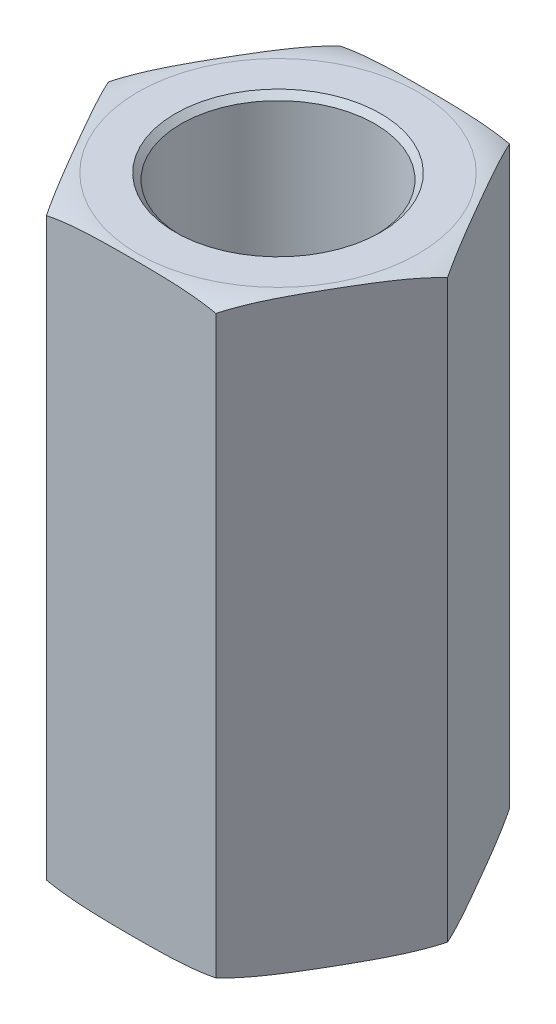
ISO-10303-21;
HEADER;
FILE_DESCRIPTION(('STEP AP214'),'2;1');
FILE_NAME('part.step','',(''),(''),'','','');
FILE_SCHEMA(('AUTOMOTIVE_DESIGN { 1 0 10303 214 1 1 1 1 }'));
ENDSEC;
DATA;
#1=APPLICATION_CONTEXT('core data for automotive mechanical design processes');
#2=APPLICATION_PROTOCOL_DEFINITION('international standard','automotive_design',2000,#1);
#3=PRODUCT_CONTEXT('',#1,'mechanical');
#4=PRODUCT('Part','Part','',(#3));
#5=PRODUCT_RELATED_PRODUCT_CATEGORY('part','',(#4));
#6=PRODUCT_DEFINITION_FORMATION('','',#4);
#7=PRODUCT_DEFINITION_CONTEXT('part definition',#1,'design');
#8=PRODUCT_DEFINITION('design','',#6,#7);
#9=PRODUCT_DEFINITION_SHAPE('','',#8);
#10=(LENGTH_UNIT() NAMED_UNIT(*) SI_UNIT(.MILLI.,.METRE.));
#11=(NAMED_UNIT(*) PLANE_ANGLE_UNIT() SI_UNIT($,.RADIAN.));
#12=(NAMED_UNIT(*) SI_UNIT($,.STERADIAN.) SOLID_ANGLE_UNIT());
#13=UNCERTAINTY_MEASURE_WITH_UNIT(LENGTH_MEASURE(1.E-05),#10,'distance_accuracy_value','');
#14=(GEOMETRIC_REPRESENTATION_CONTEXT(3) GLOBAL_UNCERTAINTY_ASSIGNED_CONTEXT((#13)) GLOBAL_UNIT_ASSIGNED_CONTEXT((#10,
#11,#12)) REPRESENTATION_CONTEXT('',''));
#15=CARTESIAN_POINT('',(0.,0.,0.));
#16=DIRECTION('',(0.,0.,1.));
#17=DIRECTION('',(1.,0.,0.));
#18=AXIS2_PLACEMENT_3D('',#15,#16,#17);
#19=CARTESIAN_POINT('',(3.66617420935412,6.35,0.));
#20=DIRECTION('',(-0.866025403784439,0.,0.5));
#21=DIRECTION('',(0.5,0.,0.866025403784439));
#22=AXIS2_PLACEMENT_3D('',#19,#20,#21);
#23=PLANE('',#22);
#24=DIRECTION('',(0.,1.,0.));
#25=VECTOR('',#24,1.);
#26=CARTESIAN_POINT('',(1.83308710467704,6.35,-3.175));
#27=LINE('',#26,#25);
#28=CARTESIAN_POINT('',(1.83308710467705,-6.223,-3.175));
#29=VERTEX_POINT('',#28);
#30=CARTESIAN_POINT('',(1.83308710467706,6.223,-3.175));
#31=VERTEX_POINT('',#30);
#32=EDGE_CURVE('E300',#29,#31,#27,.T.);
#33=ORIENTED_EDGE('',*,*,#32,.T.);
#34=CARTESIAN_POINT('',(3.66617420935412,6.223,0.));
#35=CARTESIAN_POINT('',(3.62797961467394,6.23890141489968,-0.0661549785605611));
#36=CARTESIAN_POINT('',(3.58956810864156,6.2524886076105,-0.132685658603882));
#37=CARTESIAN_POINT('',(3.5124905179571,6.27581619794021,-0.266187961794374));
#38=CARTESIAN_POINT('',(3.47382473049845,6.28556047713974,-0.33315907018741));
#39=CARTESIAN_POINT('',(3.39641631867871,6.3019966530451,-0.467234372392409));
#40=CARTESIAN_POINT('',(3.3576739963331,6.30869453286691,-0.534338043098217));
#41=CARTESIAN_POINT('',(3.28009834620111,6.31977675729319,-0.668703010557023));
#42=CARTESIAN_POINT('',(3.24126499587768,6.32416045047396,-0.735964346345314));
#43=CARTESIAN_POINT('',(3.16354065964311,6.33124030042628,-0.870586845688153));
#44=CARTESIAN_POINT('',(3.12464965374472,6.33393552375912,-0.937948043861629));
#45=CARTESIAN_POINT('',(3.04685144594589,6.33815319837134,-1.07269849250701));
#46=CARTESIAN_POINT('',(3.00794424351965,6.33967560802717,-1.14008774388963));
#47=CARTESIAN_POINT('',(2.93051517598868,6.34192270588903,-1.27419882283594));
#48=CARTESIAN_POINT('',(2.89199336248929,6.34265524681808,-1.34092056101658));
#49=CARTESIAN_POINT('',(2.81494778346138,6.34357673025741,-1.47436741839149));
#50=CARTESIAN_POINT('',(2.77642401791433,6.3437656658949,-1.54109253761784));
#51=CARTESIAN_POINT('',(2.69935964431006,6.34366599668056,-1.67457194815391));
#52=CARTESIAN_POINT('',(2.66081903631815,6.34337718117655,-1.7413262393505));
#53=CARTESIAN_POINT('',(2.58373908085323,6.34222198621899,-1.87483263846089));
#54=CARTESIAN_POINT('',(2.54519973341238,6.34135559703857,-1.94158474631899));
#55=CARTESIAN_POINT('',(2.46812969629763,6.33878619406563,-2.07507396634296));
#56=CARTESIAN_POINT('',(2.42959900625957,6.33708322716165,-2.14181107913956));
#57=CARTESIAN_POINT('',(2.352556513409,6.3324387229726,-2.27525259109851));
#58=CARTESIAN_POINT('',(2.31404470975434,6.3294972471358,-2.3419569917195));
#59=CARTESIAN_POINT('',(2.25084206239936,6.32321741247487,-2.45142718811118));
#60=CARTESIAN_POINT('',(2.22613849337002,6.32039801104631,-2.49421502479829));
#61=CARTESIAN_POINT('',(2.17676945272221,6.31386967943035,-2.57972471152123));
#62=CARTESIAN_POINT('',(2.15210397034177,6.31016108091389,-2.62244658019735));
#63=CARTESIAN_POINT('',(2.1028275381169,6.30168027114968,-2.70779586442654));
#64=CARTESIAN_POINT('',(2.07821657107524,6.29690846570083,-2.7504233097661));
#65=CARTESIAN_POINT('',(2.02900094683545,6.28609877125158,-2.83566727147563));
#66=CARTESIAN_POINT('',(2.0043964608546,6.28005773130841,-2.87828349128859));
#67=CARTESIAN_POINT('',(1.95527325900931,6.26651383541611,-2.96336737271509));
#68=CARTESIAN_POINT('',(1.93075459617612,6.25901019780296,-3.00583494247583));
#69=CARTESIAN_POINT('',(1.8818215737317,6.24232035070844,-3.09058942351747));
#70=CARTESIAN_POINT('',(1.85740744053269,6.23313149780328,-3.13287594264091));
#71=CARTESIAN_POINT('',(1.83308710467705,6.223,-3.175));
#72=B_SPLINE_CURVE_WITH_KNOTS('',3,(#34,#35,#36,#37,#38,#39,#40,#41,#42,#43,#44,#45,#46,#47,#48,
#49,#50,#51,#52,#53,#54,#55,#56,#57,#58,#59,#60,#61,#62,#63,#64,#65,#66,#67,#68,#69,#70,#71),
.UNSPECIFIED.,.F.,.F.,(4,2,2,2,2,2,2,2,2,2,2,2,2,2,2,2,2,2,4),(0.,0.233977307817956,
0.467717675040722,0.700996973557543,0.934341903229807,1.16781571967247,1.40129782179833,
1.6324366580968,1.86357841666628,2.09482211846307,2.32606971471509,2.55730435147413,
2.7885275169443,2.93698369265101,3.08538458004485,3.23372892334593,3.38244598546619,
3.53124274626087,3.68027493713585),.UNSPECIFIED.);
#73=CARTESIAN_POINT('',(3.66617420935412,6.223,0.));
#74=VERTEX_POINT('',#73);
#75=EDGE_CURVE('E94',#74,#31,#72,.T.);
#76=ORIENTED_EDGE('',*,*,#75,.F.);
#77=DIRECTION('',(0.,1.,0.));
#78=VECTOR('',#77,1.);
#79=CARTESIAN_POINT('',(3.66617420935412,6.35,0.));
#80=LINE('',#79,#78);
#81=CARTESIAN_POINT('',(3.66617420935412,-6.223,0.));
#82=VERTEX_POINT('',#81);
#83=EDGE_CURVE('E297',#74,#82,#80,.F.);
#84=ORIENTED_EDGE('',*,*,#83,.T.);
#85=CARTESIAN_POINT('',(1.83308710467705,-6.223,-3.17500000000001));
#86=CARTESIAN_POINT('',(1.87128169935723,-6.23890141489968,-3.10884502143945));
#87=CARTESIAN_POINT('',(1.90969320538961,-6.2524886076105,-3.04231434139613));
#88=CARTESIAN_POINT('',(1.98677079607407,-6.2758161979402,-2.90881203820564));
#89=CARTESIAN_POINT('',(2.02543658353272,-6.28556047713974,-2.8418409298126));
#90=CARTESIAN_POINT('',(2.10284499535245,-6.30199665304509,-2.70776562760761));
#91=CARTESIAN_POINT('',(2.14158731769806,-6.30869453286691,-2.6406619569018));
#92=CARTESIAN_POINT('',(2.21916296783006,-6.31977675729319,-2.506296989443));
#93=CARTESIAN_POINT('',(2.25799631815348,-6.32416045047396,-2.43903565365471));
#94=CARTESIAN_POINT('',(2.33572065438805,-6.33124030042628,-2.30441315431187));
#95=CARTESIAN_POINT('',(2.37461166028644,-6.33393552375912,-2.2370519561384));
#96=CARTESIAN_POINT('',(2.45240986808527,-6.33815319837134,-2.10230150749301));
#97=CARTESIAN_POINT('',(2.49131707051151,-6.33967560802717,-2.0349122561104));
#98=CARTESIAN_POINT('',(2.56874613804247,-6.34192270588903,-1.90080117716409));
#99=CARTESIAN_POINT('',(2.60726795154186,-6.34265524681808,-1.83407943898346));
#100=CARTESIAN_POINT('',(2.68431353056977,-6.34357673025741,-1.70063258160855));
#101=CARTESIAN_POINT('',(2.72283729611682,-6.3437656658949,-1.63390746238219));
#102=CARTESIAN_POINT('',(2.79990166972109,-6.34366599668056,-1.50042805184613));
#103=CARTESIAN_POINT('',(2.838442277713,-6.34337718117655,-1.43367376064954));
#104=CARTESIAN_POINT('',(2.91552223317792,-6.34222198621899,-1.30016736153915));
#105=CARTESIAN_POINT('',(2.95406158061877,-6.34135559703857,-1.23341525368106));
#106=CARTESIAN_POINT('',(3.03113161773352,-6.33878619406563,-1.09992603365709));
#107=CARTESIAN_POINT('',(3.06966230777158,-6.33708322716165,-1.03318892086049));
#108=CARTESIAN_POINT('',(3.14670480062215,-6.3324387229726,-0.899747408901539));
#109=CARTESIAN_POINT('',(3.18521660427681,-6.3294972471358,-0.833043008280551));
#110=CARTESIAN_POINT('',(3.24841925163178,-6.32321741247488,-0.72357281188887));
#111=CARTESIAN_POINT('',(3.27312282066113,-6.32039801104631,-0.68078497520176));
#112=CARTESIAN_POINT('',(3.32249186130894,-6.31386967943036,-0.595275288478811));
#113=CARTESIAN_POINT('',(3.34715734368938,-6.3101610809139,-0.552553419802693));
#114=CARTESIAN_POINT('',(3.39643377591425,-6.30168027114969,-0.467204135573495));
#115=CARTESIAN_POINT('',(3.42104474295592,-6.29690846570084,-0.424576690233926));
#116=CARTESIAN_POINT('',(3.47026036719571,-6.28609877125159,-0.339332728524397));
#117=CARTESIAN_POINT('',(3.49486485317657,-6.28005773130841,-0.296716508711431));
#118=CARTESIAN_POINT('',(3.54398805502186,-6.26651383541611,-0.211632627284922));
#119=CARTESIAN_POINT('',(3.56850671785505,-6.25901019780296,-0.169165057524186));
#120=CARTESIAN_POINT('',(3.61743974029947,-6.24232035070844,-0.084410576482538));
#121=CARTESIAN_POINT('',(3.64185387349848,-6.23313149780328,-0.0421240573590946));
#122=CARTESIAN_POINT('',(3.66617420935412,-6.223,0.));
#123=B_SPLINE_CURVE_WITH_KNOTS('',3,(#85,#86,#87,#88,#89,#90,#91,#92,#93,#94,#95,#96,#97,#98,
#99,#100,#101,#102,#103,#104,#105,#106,#107,#108,#109,#110,#111,#112,#113,#114,#115,#116,#117,
#118,#119,#120,#121,#122),.UNSPECIFIED.,.F.,.F.,(4,2,2,2,2,2,2,2,2,2,2,2,2,2,2,2,2,2,4),(0.,
0.233977307817952,0.467717675040713,0.700996973557529,0.934341903229788,1.16781571967244,
1.4012978217983,1.63243665809676,1.86357841666625,2.09482211846303,2.32606971471504,
2.55730435147408,2.78852751694424,2.93698369265097,3.08538458004482,3.23372892334591,
3.38244598546617,3.53124274626087,3.68027493713586),.UNSPECIFIED.);
#124=EDGE_CURVE('E143',#29,#82,#123,.T.);
#125=ORIENTED_EDGE('',*,*,#124,.F.);
#126=EDGE_LOOP('',(#33,#76,#84,#125));
#127=FACE_BOUND('',#126,.T.);
#128=ADVANCED_FACE('F14',(#127),#23,.F.);
#129=CARTESIAN_POINT('',(1.83308710467706,6.35,3.17499999999999));
#130=DIRECTION('',(-0.866025403784439,0.,-0.5));
#131=DIRECTION('',(-0.5,0.,0.866025403784439));
#132=AXIS2_PLACEMENT_3D('',#129,#130,#131);
#133=PLANE('',#132);
#134=ORIENTED_EDGE('',*,*,#83,.F.);
#135=CARTESIAN_POINT('',(1.83308710467706,6.223,3.17499999999999));
#136=CARTESIAN_POINT('',(1.87128169935724,6.23890141489968,3.10884502143943));
#137=CARTESIAN_POINT('',(1.90969320538962,6.2524886076105,3.04231434139611));
#138=CARTESIAN_POINT('',(1.98677079607408,6.27581619794021,2.90881203820562));
#139=CARTESIAN_POINT('',(2.02543658353273,6.28556047713974,2.84184092981258));
#140=CARTESIAN_POINT('',(2.10284499535247,6.3019966530451,2.70776562760758));
#141=CARTESIAN_POINT('',(2.14158731769808,6.30869453286691,2.64066195690177));
#142=CARTESIAN_POINT('',(2.21916296783007,6.31977675729319,2.50629698944297));
#143=CARTESIAN_POINT('',(2.2579963181535,6.32416045047396,2.43903565365468));
#144=CARTESIAN_POINT('',(2.33572065438807,6.33124030042628,2.30441315431184));
#145=CARTESIAN_POINT('',(2.37461166028646,6.33393552375912,2.23705195613836));
#146=CARTESIAN_POINT('',(2.45240986808529,6.33815319837134,2.10230150749298));
#147=CARTESIAN_POINT('',(2.49131707051153,6.33967560802717,2.03491225611036));
#148=CARTESIAN_POINT('',(2.5687461380425,6.34192270588903,1.90080117716405));
#149=CARTESIAN_POINT('',(2.60726795154189,6.34265524681808,1.83407943898341));
#150=CARTESIAN_POINT('',(2.6843135305698,6.34357673025741,1.7006325816085));
#151=CARTESIAN_POINT('',(2.72283729611685,6.3437656658949,1.63390746238215));
#152=CARTESIAN_POINT('',(2.79990166972112,6.34366599668056,1.50042805184608));
#153=CARTESIAN_POINT('',(2.83844227771304,6.34337718117655,1.43367376064949));
#154=CARTESIAN_POINT('',(2.91552223317796,6.34222198621899,1.3001673615391));
#155=CARTESIAN_POINT('',(2.9540615806188,6.34135559703857,1.233415253681));
#156=CARTESIAN_POINT('',(3.03113161773355,6.33878619406563,1.09992603365703));
#157=CARTESIAN_POINT('',(3.06966230777161,6.33708322716165,1.03318892086043));
#158=CARTESIAN_POINT('',(3.14670480062218,6.3324387229726,0.899747408901478));
#159=CARTESIAN_POINT('',(3.18521660427684,6.3294972471358,0.833043008280487));
#160=CARTESIAN_POINT('',(3.24841925163182,6.32321741247487,0.723572811888809));
#161=CARTESIAN_POINT('',(3.27312282066116,6.32039801104631,0.680784975201703));
#162=CARTESIAN_POINT('',(3.32249186130897,6.31386967943035,0.595275288478763));
#163=CARTESIAN_POINT('',(3.34715734368941,6.31016108091389,0.552553419802648));
#164=CARTESIAN_POINT('',(3.39643377591428,6.30168027114968,0.467204135573458));
#165=CARTESIAN_POINT('',(3.42104474295594,6.29690846570083,0.424576690233893));
#166=CARTESIAN_POINT('',(3.47026036719572,6.28609877125158,0.339332728524371));
#167=CARTESIAN_POINT('',(3.49486485317658,6.28005773130841,0.29671650871141));
#168=CARTESIAN_POINT('',(3.54398805502187,6.26651383541611,0.211632627284908));
#169=CARTESIAN_POINT('',(3.56850671785506,6.25901019780296,0.169165057524176));
#170=CARTESIAN_POINT('',(3.61743974029948,6.24232035070844,0.0844105764825357));
#171=CARTESIAN_POINT('',(3.64185387349849,6.23313149780328,0.0421240573590963));
#172=CARTESIAN_POINT('',(3.66617420935412,6.223,0.));
#173=B_SPLINE_CURVE_WITH_KNOTS('',3,(#135,#136,#137,#138,#139,#140,#141,#142,#143,#144,#145,
#146,#147,#148,#149,#150,#151,#152,#153,#154,#155,#156,#157,#158,#159,#160,#161,#162,#163,#164,
#165,#166,#167,#168,#169,#170,#171,#172),.UNSPECIFIED.,.F.,.F.,(4,2,2,2,2,2,2,2,2,2,2,2,2,2,2,2,
2,2,4),(0.,0.233977307817956,0.467717675040722,0.700996973557543,0.934341903229808,
1.16781571967247,1.40129782179833,1.6324366580968,1.86357841666628,2.09482211846307,
2.32606971471509,2.55730435147413,2.7885275169443,2.93698369265101,3.08538458004485,
3.23372892334593,3.38244598546618,3.53124274626086,3.68027493713584),.UNSPECIFIED.);
#174=CARTESIAN_POINT('',(1.83308710467706,6.223,3.17499999999999));
#175=VERTEX_POINT('',#174);
#176=EDGE_CURVE('E171',#175,#74,#173,.T.);
#177=ORIENTED_EDGE('',*,*,#176,.F.);
#178=DIRECTION('',(0.,1.,0.));
#179=VECTOR('',#178,1.);
#180=CARTESIAN_POINT('',(1.83308710467706,6.35,3.17499999999999));
#181=LINE('',#180,#179);
#182=CARTESIAN_POINT('',(1.83308710467706,-6.223,3.17499999999999));
#183=VERTEX_POINT('',#182);
#184=EDGE_CURVE('E295',#175,#183,#181,.F.);
#185=ORIENTED_EDGE('',*,*,#184,.T.);
#186=CARTESIAN_POINT('',(3.66617420935412,-6.223,0.));
#187=CARTESIAN_POINT('',(3.62797961467394,-6.23890141489968,0.0661549785605662));
#188=CARTESIAN_POINT('',(3.58956810864156,-6.2524886076105,0.132685658603887));
#189=CARTESIAN_POINT('',(3.5124905179571,-6.27581619794021,0.266187961794379));
#190=CARTESIAN_POINT('',(3.47382473049845,-6.28556047713974,0.333159070187415));
#191=CARTESIAN_POINT('',(3.39641631867871,-6.3019966530451,0.467234372392414));
#192=CARTESIAN_POINT('',(3.3576739963331,-6.30869453286691,0.534338043098222));
#193=CARTESIAN_POINT('',(3.28009834620111,-6.31977675729319,0.668703010557028));
#194=CARTESIAN_POINT('',(3.24126499587768,-6.32416045047396,0.73596434634532));
#195=CARTESIAN_POINT('',(3.16354065964311,-6.33124030042628,0.870586845688159));
#196=CARTESIAN_POINT('',(3.12464965374472,-6.33393552375912,0.937948043861634));
#197=CARTESIAN_POINT('',(3.04685144594589,-6.33815319837134,1.07269849250702));
#198=CARTESIAN_POINT('',(3.00794424351965,-6.33967560802717,1.14008774388963));
#199=CARTESIAN_POINT('',(2.93051517598868,-6.34192270588903,1.27419882283595));
#200=CARTESIAN_POINT('',(2.89199336248929,-6.34265524681808,1.34092056101658));
#201=CARTESIAN_POINT('',(2.81494778346138,-6.34357673025741,1.47436741839149));
#202=CARTESIAN_POINT('',(2.77642401791433,-6.3437656658949,1.54109253761785));
#203=CARTESIAN_POINT('',(2.69935964431006,-6.34366599668056,1.67457194815392));
#204=CARTESIAN_POINT('',(2.66081903631815,-6.34337718117655,1.74132623935051));
#205=CARTESIAN_POINT('',(2.58373908085322,-6.34222198621899,1.8748326384609));
#206=CARTESIAN_POINT('',(2.54519973341238,-6.34135559703857,1.941584746319));
#207=CARTESIAN_POINT('',(2.46812969629763,-6.33878619406563,2.07507396634296));
#208=CARTESIAN_POINT('',(2.42959900625957,-6.33708322716165,2.14181107913957));
#209=CARTESIAN_POINT('',(2.352556513409,-6.3324387229726,2.27525259109852));
#210=CARTESIAN_POINT('',(2.31404470975434,-6.3294972471358,2.34195699171951));
#211=CARTESIAN_POINT('',(2.25084206239936,-6.32321741247487,2.45142718811119));
#212=CARTESIAN_POINT('',(2.22613849337002,-6.32039801104631,2.49421502479829));
#213=CARTESIAN_POINT('',(2.17676945272221,-6.31386967943035,2.57972471152123));
#214=CARTESIAN_POINT('',(2.15210397034177,-6.31016108091389,2.62244658019735));
#215=CARTESIAN_POINT('',(2.1028275381169,-6.30168027114968,2.70779586442654));
#216=CARTESIAN_POINT('',(2.07821657107524,-6.29690846570083,2.7504233097661));
#217=CARTESIAN_POINT('',(2.02900094683546,-6.28609877125158,2.83566727147563));
#218=CARTESIAN_POINT('',(2.0043964608546,-6.28005773130841,2.87828349128859));
#219=CARTESIAN_POINT('',(1.95527325900931,-6.26651383541611,2.96336737271509));
#220=CARTESIAN_POINT('',(1.93075459617612,-6.25901019780296,3.00583494247582));
#221=CARTESIAN_POINT('',(1.88182157373171,-6.24232035070844,3.09058942351746));
#222=CARTESIAN_POINT('',(1.8574074405327,-6.23313149780328,3.1328759426409));
#223=CARTESIAN_POINT('',(1.83308710467706,-6.223,3.17499999999999));
#224=B_SPLINE_CURVE_WITH_KNOTS('',3,(#186,#187,#188,#189,#190,#191,#192,#193,#194,#195,#196,
#197,#198,#199,#200,#201,#202,#203,#204,#205,#206,#207,#208,#209,#210,#211,#212,#213,#214,#215,
#216,#217,#218,#219,#220,#221,#222,#223),.UNSPECIFIED.,.F.,.F.,(4,2,2,2,2,2,2,2,2,2,2,2,2,2,2,2,
2,2,4),(0.,0.233977307817956,0.467717675040723,0.700996973557543,0.934341903229807,
1.16781571967247,1.40129782179833,1.6324366580968,1.86357841666628,2.09482211846307,
2.32606971471509,2.55730435147414,2.7885275169443,2.93698369265102,3.08538458004485,
3.23372892334593,3.38244598546618,3.53124274626086,3.68027493713584),.UNSPECIFIED.);
#225=EDGE_CURVE('E150',#82,#183,#224,.T.);
#226=ORIENTED_EDGE('',*,*,#225,.F.);
#227=EDGE_LOOP('',(#134,#177,#185,#226));
#228=FACE_BOUND('',#227,.T.);
#229=ADVANCED_FACE('F162',(#228),#133,.F.);
#230=CARTESIAN_POINT('',(1.83308710467706,6.35,-3.175));
#231=DIRECTION('',(0.,0.,1.));
#232=DIRECTION('',(1.,0.,0.));
#233=AXIS2_PLACEMENT_3D('',#230,#231,#232);
#234=PLANE('',#233);
#235=DIRECTION('',(0.,1.,0.));
#236=VECTOR('',#235,1.);
#237=CARTESIAN_POINT('',(-1.83308710467707,6.35,-3.175));
#238=LINE('',#237,#236);
#239=CARTESIAN_POINT('',(-1.83308710467707,-6.223,-3.175));
#240=VERTEX_POINT('',#239);
#241=CARTESIAN_POINT('',(-1.83308710467706,6.223,-3.17500000000001));
#242=VERTEX_POINT('',#241);
#243=EDGE_CURVE('E101',#240,#242,#238,.T.);
#244=ORIENTED_EDGE('',*,*,#243,.T.);
#245=CARTESIAN_POINT('',(1.83308710467706,6.223,-3.175));
#246=CARTESIAN_POINT('',(1.73237579828683,6.24394001415179,-3.175));
#247=CARTESIAN_POINT('',(1.63096506893486,6.26088534953273,-3.175));
#248=CARTESIAN_POINT('',(1.42767146651469,6.28849716439842,-3.175));
#249=CARTESIAN_POINT('',(1.32579191427254,6.29918756587531,-3.175));
#250=CARTESIAN_POINT('',(1.12177634709137,6.31612804080793,-3.175));
#251=CARTESIAN_POINT('',(1.0196405664338,6.32238127071887,-3.175));
#252=CARTESIAN_POINT('',(0.815663681397375,6.33190280641833,-3.175));
#253=CARTESIAN_POINT('',(0.713823115514573,6.3351834044999,-3.175));
#254=CARTESIAN_POINT('',(0.510018485441651,6.33994548487028,-3.175));
#255=CARTESIAN_POINT('',(0.408054390577976,6.34142541008817,-3.175));
#256=CARTESIAN_POINT('',(0.20406020033787,6.34331468183792,-3.175));
#257=CARTESIAN_POINT('',(0.102030100168935,6.3437234241492,-3.175));
#258=CARTESIAN_POINT('',(-0.102030100168934,6.3437234241492,-3.175));
#259=CARTESIAN_POINT('',(-0.204060200337869,6.34331468183792,-3.175));
#260=CARTESIAN_POINT('',(-0.408054390577974,6.34142541008817,-3.175));
#261=CARTESIAN_POINT('',(-0.510018485441649,6.33994548487028,-3.175));
#262=CARTESIAN_POINT('',(-0.71382311551457,6.3351834044999,-3.175));
#263=CARTESIAN_POINT('',(-0.815663681397372,6.33190280641833,-3.175));
#264=CARTESIAN_POINT('',(-1.01964056643379,6.32238127071887,-3.175));
#265=CARTESIAN_POINT('',(-1.12177634709137,6.31612804080793,-3.175));
#266=CARTESIAN_POINT('',(-1.32579191427253,6.29918756587531,-3.175));
#267=CARTESIAN_POINT('',(-1.42767146651468,6.28849716439842,-3.175));
#268=CARTESIAN_POINT('',(-1.63096506893485,6.26088534953273,-3.175));
#269=CARTESIAN_POINT('',(-1.73237579828682,6.24394001415179,-3.175));
#270=CARTESIAN_POINT('',(-1.83308710467705,6.223,-3.175));
#271=B_SPLINE_CURVE_WITH_KNOTS('',3,(#245,#246,#247,#248,#249,#250,#251,#252,#253,#254,#255,
#256,#257,#258,#259,#260,#261,#262,#263,#264,#265,#266,#267,#268,#269,#270),.UNSPECIFIED.,.F.,
.F.,(4,2,2,2,2,2,2,2,2,2,2,2,4),(0.,0.308333242342807,0.615479423308234,0.922406891130008,
1.2280592962085,1.53397581645216,1.84006485747889,2.14615389850561,2.45207041874927,
2.75772282382776,3.06465029164953,3.37179647261496,3.68012971495777),.UNSPECIFIED.);
#272=EDGE_CURVE('E86',#31,#242,#271,.T.);
#273=ORIENTED_EDGE('',*,*,#272,.F.);
#274=ORIENTED_EDGE('',*,*,#32,.F.);
#275=CARTESIAN_POINT('',(-1.83308710467707,-6.223,-3.175));
#276=CARTESIAN_POINT('',(-1.73237579828684,-6.24394001415179,-3.175));
#277=CARTESIAN_POINT('',(-1.63096506893487,-6.26088534953273,-3.175));
#278=CARTESIAN_POINT('',(-1.4276714665147,-6.28849716439842,-3.175));
#279=CARTESIAN_POINT('',(-1.32579191427255,-6.2991875658753,-3.175));
#280=CARTESIAN_POINT('',(-1.12177634709138,-6.31612804080793,-3.175));
#281=CARTESIAN_POINT('',(-1.0196405664338,-6.32238127071887,-3.175));
#282=CARTESIAN_POINT('',(-0.81566368139738,-6.33190280641833,-3.175));
#283=CARTESIAN_POINT('',(-0.713823115514577,-6.3351834044999,-3.175));
#284=CARTESIAN_POINT('',(-0.510018485441654,-6.33994548487028,-3.175));
#285=CARTESIAN_POINT('',(-0.408054390577979,-6.34142541008817,-3.175));
#286=CARTESIAN_POINT('',(-0.204060200337872,-6.34331468183792,-3.175));
#287=CARTESIAN_POINT('',(-0.102030100168936,-6.3437234241492,-3.175));
#288=CARTESIAN_POINT('',(0.102030100168934,-6.3437234241492,-3.175));
#289=CARTESIAN_POINT('',(0.204060200337869,-6.34331468183792,-3.175));
#290=CARTESIAN_POINT('',(0.408054390577974,-6.34142541008817,-3.175));
#291=CARTESIAN_POINT('',(0.510018485441648,-6.33994548487028,-3.175));
#292=CARTESIAN_POINT('',(0.713823115514568,-6.3351834044999,-3.175));
#293=CARTESIAN_POINT('',(0.81566368139737,-6.33190280641833,-3.175));
#294=CARTESIAN_POINT('',(1.01964056643379,-6.32238127071887,-3.175));
#295=CARTESIAN_POINT('',(1.12177634709137,-6.31612804080793,-3.175));
#296=CARTESIAN_POINT('',(1.32579191427253,-6.29918756587531,-3.175));
#297=CARTESIAN_POINT('',(1.42767146651468,-6.28849716439842,-3.175));
#298=CARTESIAN_POINT('',(1.63096506893485,-6.26088534953273,-3.175));
#299=CARTESIAN_POINT('',(1.73237579828682,-6.24394001415179,-3.175));
#300=CARTESIAN_POINT('',(1.83308710467705,-6.223,-3.175));
#301=B_SPLINE_CURVE_WITH_KNOTS('',3,(#275,#276,#277,#278,#279,#280,#281,#282,#283,#284,#285,
#286,#287,#288,#289,#290,#291,#292,#293,#294,#295,#296,#297,#298,#299,#300),.UNSPECIFIED.,.F.,
.F.,(4,2,2,2,2,2,2,2,2,2,2,2,4),(0.,0.308333242342808,0.615479423308238,0.922406891130013,
1.22805929620851,1.53397581645217,1.8400648574789,2.14615389850562,2.45207041874928,
2.75772282382777,3.06465029164954,3.37179647261497,3.68012971495777),.UNSPECIFIED.);
#302=EDGE_CURVE('E103',#240,#29,#301,.T.);
#303=ORIENTED_EDGE('',*,*,#302,.F.);
#304=EDGE_LOOP('',(#244,#273,#274,#303));
#305=FACE_BOUND('',#304,.T.);
#306=ADVANCED_FACE('F102',(#305),#234,.F.);
#307=CARTESIAN_POINT('',(-1.83308710467707,6.35,3.175));
#308=DIRECTION('',(0.,0.,-1.));
#309=DIRECTION('',(-1.,0.,0.));
#310=AXIS2_PLACEMENT_3D('',#307,#308,#309);
#311=PLANE('',#310);
#312=ORIENTED_EDGE('',*,*,#184,.F.);
#313=CARTESIAN_POINT('',(-1.83308710467706,6.223,3.175));
#314=CARTESIAN_POINT('',(-1.73237579828684,6.24394001415179,3.175));
#315=CARTESIAN_POINT('',(-1.63096506893486,6.26088534953273,3.175));
#316=CARTESIAN_POINT('',(-1.42767146651469,6.28849716439842,3.175));
#317=CARTESIAN_POINT('',(-1.32579191427254,6.29918756587531,3.175));
#318=CARTESIAN_POINT('',(-1.12177634709138,6.31612804080793,3.175));
#319=CARTESIAN_POINT('',(-1.0196405664338,6.32238127071887,3.175));
#320=CARTESIAN_POINT('',(-0.815663681397378,6.33190280641833,3.175));
#321=CARTESIAN_POINT('',(-0.713823115514575,6.3351834044999,3.175));
#322=CARTESIAN_POINT('',(-0.510018485441652,6.33994548487028,3.175));
#323=CARTESIAN_POINT('',(-0.408054390577977,6.34142541008817,3.175));
#324=CARTESIAN_POINT('',(-0.204060200337871,6.34331468183792,3.175));
#325=CARTESIAN_POINT('',(-0.102030100168935,6.3437234241492,3.17499999999999));
#326=CARTESIAN_POINT('',(0.102030100168935,6.3437234241492,3.17499999999999));
#327=CARTESIAN_POINT('',(0.204060200337871,6.34331468183792,3.17499999999999));
#328=CARTESIAN_POINT('',(0.408054390577978,6.34142541008817,3.17499999999999));
#329=CARTESIAN_POINT('',(0.510018485441652,6.33994548487028,3.17499999999999));
#330=CARTESIAN_POINT('',(0.713823115514575,6.3351834044999,3.17499999999999));
#331=CARTESIAN_POINT('',(0.815663681397378,6.33190280641833,3.17499999999999));
#332=CARTESIAN_POINT('',(1.0196405664338,6.32238127071887,3.17499999999999));
#333=CARTESIAN_POINT('',(1.12177634709138,6.31612804080793,3.17499999999999));
#334=CARTESIAN_POINT('',(1.32579191427254,6.29918756587531,3.17499999999999));
#335=CARTESIAN_POINT('',(1.42767146651469,6.28849716439842,3.17499999999999));
#336=CARTESIAN_POINT('',(1.63096506893486,6.26088534953273,3.17499999999999));
#337=CARTESIAN_POINT('',(1.73237579828684,6.24394001415179,3.17499999999999));
#338=CARTESIAN_POINT('',(1.83308710467706,6.223,3.17499999999999));
#339=B_SPLINE_CURVE_WITH_KNOTS('',3,(#313,#314,#315,#316,#317,#318,#319,#320,#321,#322,#323,
#324,#325,#326,#327,#328,#329,#330,#331,#332,#333,#334,#335,#336,#337,#338),.UNSPECIFIED.,.F.,
.F.,(4,2,2,2,2,2,2,2,2,2,2,2,4),(0.,0.308333242342808,0.615479423308237,0.922406891130011,
1.2280592962085,1.53397581645216,1.84006485747889,2.14615389850562,2.45207041874928,
2.75772282382777,3.06465029164955,3.37179647261498,3.68012971495778),.UNSPECIFIED.);
#340=CARTESIAN_POINT('',(-1.83308710467707,6.223,3.175));
#341=VERTEX_POINT('',#340);
#342=EDGE_CURVE('E97',#341,#175,#339,.T.);
#343=ORIENTED_EDGE('',*,*,#342,.F.);
#344=DIRECTION('',(0.,1.,0.));
#345=VECTOR('',#344,1.);
#346=CARTESIAN_POINT('',(-1.83308710467707,6.35,3.175));
#347=LINE('',#346,#345);
#348=CARTESIAN_POINT('',(-1.83308710467706,-6.223,3.175));
#349=VERTEX_POINT('',#348);
#350=EDGE_CURVE('E105',#341,#349,#347,.F.);
#351=ORIENTED_EDGE('',*,*,#350,.T.);
#352=CARTESIAN_POINT('',(1.83308710467706,-6.223,3.17499999999999));
#353=CARTESIAN_POINT('',(1.73237579828684,-6.24394001415179,3.17499999999999));
#354=CARTESIAN_POINT('',(1.63096506893486,-6.26088534953273,3.17499999999999));
#355=CARTESIAN_POINT('',(1.4276714665147,-6.28849716439842,3.17499999999999));
#356=CARTESIAN_POINT('',(1.32579191427254,-6.29918756587531,3.17499999999999));
#357=CARTESIAN_POINT('',(1.12177634709138,-6.31612804080793,3.17499999999999));
#358=CARTESIAN_POINT('',(1.0196405664338,-6.32238127071887,3.17499999999999));
#359=CARTESIAN_POINT('',(0.815663681397379,-6.33190280641833,3.17499999999999));
#360=CARTESIAN_POINT('',(0.713823115514576,-6.3351834044999,3.17499999999999));
#361=CARTESIAN_POINT('',(0.510018485441653,-6.33994548487028,3.17499999999999));
#362=CARTESIAN_POINT('',(0.408054390577978,-6.34142541008817,3.17499999999999));
#363=CARTESIAN_POINT('',(0.204060200337871,-6.34331468183792,3.17499999999999));
#364=CARTESIAN_POINT('',(0.102030100168935,-6.3437234241492,3.17499999999999));
#365=CARTESIAN_POINT('',(-0.102030100168935,-6.3437234241492,3.17499999999999));
#366=CARTESIAN_POINT('',(-0.204060200337871,-6.34331468183792,3.175));
#367=CARTESIAN_POINT('',(-0.408054390577977,-6.34142541008817,3.175));
#368=CARTESIAN_POINT('',(-0.510018485441652,-6.33994548487028,3.175));
#369=CARTESIAN_POINT('',(-0.713823115514575,-6.3351834044999,3.175));
#370=CARTESIAN_POINT('',(-0.815663681397377,-6.33190280641833,3.175));
#371=CARTESIAN_POINT('',(-1.0196405664338,-6.32238127071887,3.175));
#372=CARTESIAN_POINT('',(-1.12177634709138,-6.31612804080793,3.175));
#373=CARTESIAN_POINT('',(-1.32579191427254,-6.29918756587531,3.175));
#374=CARTESIAN_POINT('',(-1.42767146651469,-6.28849716439842,3.175));
#375=CARTESIAN_POINT('',(-1.63096506893486,-6.26088534953273,3.175));
#376=CARTESIAN_POINT('',(-1.73237579828684,-6.24394001415179,3.175));
#377=CARTESIAN_POINT('',(-1.83308710467706,-6.223,3.175));
#378=B_SPLINE_CURVE_WITH_KNOTS('',3,(#352,#353,#354,#355,#356,#357,#358,#359,#360,#361,#362,
#363,#364,#365,#366,#367,#368,#369,#370,#371,#372,#373,#374,#375,#376,#377),.UNSPECIFIED.,.F.,
.F.,(4,2,2,2,2,2,2,2,2,2,2,2,4),(0.,0.308333242342808,0.615479423308237,0.922406891130012,
1.22805929620851,1.53397581645217,1.84006485747889,2.14615389850562,2.45207041874928,
2.75772282382777,3.06465029164955,3.37179647261498,3.68012971495779),.UNSPECIFIED.);
#379=EDGE_CURVE('E193',#183,#349,#378,.T.);
#380=ORIENTED_EDGE('',*,*,#379,.F.);
#381=EDGE_LOOP('',(#312,#343,#351,#380));
#382=FACE_BOUND('',#381,.T.);
#383=ADVANCED_FACE('F186',(#382),#311,.F.);
#384=CARTESIAN_POINT('',(-3.66617420935413,6.35,0.));
#385=DIRECTION('',(0.866025403784439,0.,-0.499999999999999));
#386=DIRECTION('',(-0.499999999999999,0.,-0.866025403784439));
#387=AXIS2_PLACEMENT_3D('',#384,#385,#386);
#388=PLANE('',#387);
#389=ORIENTED_EDGE('',*,*,#350,.F.);
#390=CARTESIAN_POINT('',(-3.66617420935412,6.223,0.));
#391=CARTESIAN_POINT('',(-3.62797961467395,6.23890141489968,0.0661549785605656));
#392=CARTESIAN_POINT('',(-3.58956810864157,6.2524886076105,0.132685658603886));
#393=CARTESIAN_POINT('',(-3.5124905179571,6.27581619794021,0.266187961794378));
#394=CARTESIAN_POINT('',(-3.47382473049846,6.28556047713974,0.333159070187413));
#395=CARTESIAN_POINT('',(-3.39641631867872,6.30199665304509,0.467234372392413));
#396=CARTESIAN_POINT('',(-3.35767399633311,6.30869453286691,0.53433804309822));
#397=CARTESIAN_POINT('',(-3.28009834620111,6.31977675729319,0.668703010557026));
#398=CARTESIAN_POINT('',(-3.24126499587769,6.32416045047396,0.735964346345317));
#399=CARTESIAN_POINT('',(-3.16354065964312,6.33124030042628,0.870586845688156));
#400=CARTESIAN_POINT('',(-3.12464965374473,6.33393552375912,0.937948043861631));
#401=CARTESIAN_POINT('',(-3.04685144594589,6.33815319837134,1.07269849250702));
#402=CARTESIAN_POINT('',(-3.00794424351966,6.33967560802717,1.14008774388963));
#403=CARTESIAN_POINT('',(-2.93051517598869,6.34192270588903,1.27419882283594));
#404=CARTESIAN_POINT('',(-2.8919933624893,6.34265524681808,1.34092056101658));
#405=CARTESIAN_POINT('',(-2.81494778346139,6.34357673025741,1.47436741839149));
#406=CARTESIAN_POINT('',(-2.77642401791434,6.3437656658949,1.54109253761784));
#407=CARTESIAN_POINT('',(-2.69935964431007,6.34366599668056,1.67457194815391));
#408=CARTESIAN_POINT('',(-2.66081903631816,6.34337718117655,1.7413262393505));
#409=CARTESIAN_POINT('',(-2.58373908085323,6.34222198621899,1.87483263846089));
#410=CARTESIAN_POINT('',(-2.54519973341239,6.34135559703857,1.94158474631899));
#411=CARTESIAN_POINT('',(-2.46812969629764,6.33878619406563,2.07507396634296));
#412=CARTESIAN_POINT('',(-2.42959900625958,6.33708322716165,2.14181107913956));
#413=CARTESIAN_POINT('',(-2.35255651340901,6.3324387229726,2.27525259109851));
#414=CARTESIAN_POINT('',(-2.31404470975435,6.3294972471358,2.3419569917195));
#415=CARTESIAN_POINT('',(-2.25084206239937,6.32321741247487,2.45142718811118));
#416=CARTESIAN_POINT('',(-2.22613849337003,6.32039801104631,2.49421502479829));
#417=CARTESIAN_POINT('',(-2.17676945272222,6.31386967943035,2.57972471152123));
#418=CARTESIAN_POINT('',(-2.15210397034178,6.31016108091389,2.62244658019735));
#419=CARTESIAN_POINT('',(-2.10282753811691,6.30168027114968,2.70779586442654));
#420=CARTESIAN_POINT('',(-2.07821657107525,6.29690846570083,2.7504233097661));
#421=CARTESIAN_POINT('',(-2.02900094683547,6.28609877125158,2.83566727147563));
#422=CARTESIAN_POINT('',(-2.00439646085461,6.28005773130841,2.87828349128859));
#423=CARTESIAN_POINT('',(-1.95527325900932,6.26651383541611,2.96336737271509));
#424=CARTESIAN_POINT('',(-1.93075459617613,6.25901019780295,3.00583494247582));
#425=CARTESIAN_POINT('',(-1.88182157373171,6.24232035070844,3.09058942351747));
#426=CARTESIAN_POINT('',(-1.8574074405327,6.23313149780328,3.13287594264091));
#427=CARTESIAN_POINT('',(-1.83308710467707,6.223,3.175));
#428=B_SPLINE_CURVE_WITH_KNOTS('',3,(#390,#391,#392,#393,#394,#395,#396,#397,#398,#399,#400,
#401,#402,#403,#404,#405,#406,#407,#408,#409,#410,#411,#412,#413,#414,#415,#416,#417,#418,#419,
#420,#421,#422,#423,#424,#425,#426,#427),.UNSPECIFIED.,.F.,.F.,(4,2,2,2,2,2,2,2,2,2,2,2,2,2,2,2,
2,2,4),(0.,0.233977307817955,0.467717675040721,0.70099697355754,0.934341903229804,
1.16781571967246,1.40129782179833,1.63243665809679,1.86357841666628,2.09482211846306,
2.32606971471508,2.55730435147412,2.78852751694429,2.93698369265101,3.08538458004484,
3.23372892334592,3.38244598546618,3.53124274626086,3.68027493713584),.UNSPECIFIED.);
#429=CARTESIAN_POINT('',(-3.66617420935413,6.223,0.));
#430=VERTEX_POINT('',#429);
#431=EDGE_CURVE('E98',#430,#341,#428,.T.);
#432=ORIENTED_EDGE('',*,*,#431,.F.);
#433=DIRECTION('',(0.,1.,0.));
#434=VECTOR('',#433,1.);
#435=CARTESIAN_POINT('',(-3.66617420935413,6.35,0.));
#436=LINE('',#435,#434);
#437=CARTESIAN_POINT('',(-3.66617420935412,-6.223,0.));
#438=VERTEX_POINT('',#437);
#439=EDGE_CURVE('E80',#430,#438,#436,.F.);
#440=ORIENTED_EDGE('',*,*,#439,.T.);
#441=CARTESIAN_POINT('',(-1.83308710467707,-6.223,3.175));
#442=CARTESIAN_POINT('',(-1.87128169935724,-6.23890141489968,3.10884502143944));
#443=CARTESIAN_POINT('',(-1.90969320538962,-6.25248860761049,3.04231434139612));
#444=CARTESIAN_POINT('',(-1.98677079607409,-6.2758161979402,2.90881203820563));
#445=CARTESIAN_POINT('',(-2.02543658353273,-6.28556047713974,2.84184092981259));
#446=CARTESIAN_POINT('',(-2.10284499535247,-6.30199665304509,2.7077656276076));
#447=CARTESIAN_POINT('',(-2.14158731769808,-6.30869453286691,2.64066195690179));
#448=CARTESIAN_POINT('',(-2.21916296783007,-6.31977675729319,2.50629698944299));
#449=CARTESIAN_POINT('',(-2.25799631815349,-6.32416045047396,2.4390356536547));
#450=CARTESIAN_POINT('',(-2.33572065438806,-6.33124030042628,2.30441315431186));
#451=CARTESIAN_POINT('',(-2.37461166028645,-6.33393552375911,2.23705195613839));
#452=CARTESIAN_POINT('',(-2.45240986808529,-6.33815319837134,2.102301507493));
#453=CARTESIAN_POINT('',(-2.49131707051152,-6.33967560802717,2.03491225611039));
#454=CARTESIAN_POINT('',(-2.56874613804249,-6.34192270588903,1.90080117716408));
#455=CARTESIAN_POINT('',(-2.60726795154188,-6.34265524681808,1.83407943898344));
#456=CARTESIAN_POINT('',(-2.68431353056979,-6.34357673025741,1.70063258160854));
#457=CARTESIAN_POINT('',(-2.72283729611684,-6.3437656658949,1.63390746238218));
#458=CARTESIAN_POINT('',(-2.79990166972111,-6.34366599668056,1.50042805184611));
#459=CARTESIAN_POINT('',(-2.83844227771302,-6.34337718117655,1.43367376064953));
#460=CARTESIAN_POINT('',(-2.91552223317794,-6.34222198621899,1.30016736153914));
#461=CARTESIAN_POINT('',(-2.95406158061879,-6.34135559703857,1.23341525368104));
#462=CARTESIAN_POINT('',(-3.03113161773353,-6.33878619406563,1.09992603365708));
#463=CARTESIAN_POINT('',(-3.06966230777159,-6.33708322716165,1.03318892086047));
#464=CARTESIAN_POINT('',(-3.14670480062216,-6.3324387229726,0.899747408901524));
#465=CARTESIAN_POINT('',(-3.18521660427682,-6.3294972471358,0.833043008280535));
#466=CARTESIAN_POINT('',(-3.2484192516318,-6.32321741247488,0.723572811888855));
#467=CARTESIAN_POINT('',(-3.27312282066114,-6.32039801104631,0.680784975201747));
#468=CARTESIAN_POINT('',(-3.32249186130896,-6.31386967943036,0.595275288478801));
#469=CARTESIAN_POINT('',(-3.3471573436894,-6.31016108091389,0.552553419802684));
#470=CARTESIAN_POINT('',(-3.39643377591426,-6.30168027114968,0.467204135573488));
#471=CARTESIAN_POINT('',(-3.42104474295593,-6.29690846570083,0.42457669023392));
#472=CARTESIAN_POINT('',(-3.47026036719572,-6.28609877125159,0.339332728524393));
#473=CARTESIAN_POINT('',(-3.49486485317657,-6.28005773130841,0.296716508711429));
#474=CARTESIAN_POINT('',(-3.54398805502187,-6.26651383541611,0.211632627284921));
#475=CARTESIAN_POINT('',(-3.56850671785506,-6.25901019780296,0.169165057524187));
#476=CARTESIAN_POINT('',(-3.61743974029948,-6.24232035070844,0.0844105764825412));
#477=CARTESIAN_POINT('',(-3.64185387349849,-6.23313149780328,0.0421240573590989));
#478=CARTESIAN_POINT('',(-3.66617420935412,-6.223,0.));
#479=B_SPLINE_CURVE_WITH_KNOTS('',3,(#441,#442,#443,#444,#445,#446,#447,#448,#449,#450,#451,
#452,#453,#454,#455,#456,#457,#458,#459,#460,#461,#462,#463,#464,#465,#466,#467,#468,#469,#470,
#471,#472,#473,#474,#475,#476,#477,#478),.UNSPECIFIED.,.F.,.F.,(4,2,2,2,2,2,2,2,2,2,2,2,2,2,2,2,
2,2,4),(0.,0.233977307817952,0.467717675040715,0.70099697355753,0.934341903229791,
1.16781571967245,1.40129782179831,1.63243665809677,1.86357841666625,2.09482211846303,
2.32606971471505,2.55730435147409,2.78852751694425,2.93698369265097,3.08538458004482,
3.2337289233459,3.38244598546616,3.53124274626086,3.68027493713584),.UNSPECIFIED.);
#480=EDGE_CURVE('E198',#349,#438,#479,.T.);
#481=ORIENTED_EDGE('',*,*,#480,.F.);
#482=EDGE_LOOP('',(#389,#432,#440,#481));
#483=FACE_BOUND('',#482,.T.);
#484=ADVANCED_FACE('F189',(#483),#388,.F.);
#485=CARTESIAN_POINT('',(-1.83308710467707,6.35,-3.175));
#486=DIRECTION('',(0.866025403784439,0.,0.5));
#487=DIRECTION('',(0.5,0.,-0.866025403784439));
#488=AXIS2_PLACEMENT_3D('',#485,#486,#487);
#489=PLANE('',#488);
#490=ORIENTED_EDGE('',*,*,#439,.F.);
#491=CARTESIAN_POINT('',(-1.83308710467706,6.22299999999999,-3.17500000000001));
#492=CARTESIAN_POINT('',(-1.87128169935723,6.23890141489968,-3.10884502143945));
#493=CARTESIAN_POINT('',(-1.90969320538961,6.25248860761049,-3.04231434139613));
#494=CARTESIAN_POINT('',(-1.98677079607408,6.2758161979402,-2.90881203820565));
#495=CARTESIAN_POINT('',(-2.02543658353272,6.28556047713973,-2.84184092981261));
#496=CARTESIAN_POINT('',(-2.10284499535246,6.30199665304509,-2.70776562760762));
#497=CARTESIAN_POINT('',(-2.14158731769807,6.30869453286691,-2.64066195690181));
#498=CARTESIAN_POINT('',(-2.21916296783006,6.31977675729319,-2.50629698944301));
#499=CARTESIAN_POINT('',(-2.25799631815348,6.32416045047396,-2.43903565365472));
#500=CARTESIAN_POINT('',(-2.33572065438805,6.33124030042628,-2.30441315431188));
#501=CARTESIAN_POINT('',(-2.37461166028644,6.33393552375911,-2.23705195613841));
#502=CARTESIAN_POINT('',(-2.45240986808527,6.33815319837134,-2.10230150749303));
#503=CARTESIAN_POINT('',(-2.49131707051151,6.33967560802717,-2.03491225611042));
#504=CARTESIAN_POINT('',(-2.56874613804247,6.34192270588903,-1.90080117716411));
#505=CARTESIAN_POINT('',(-2.60726795154186,6.34265524681808,-1.83407943898348));
#506=CARTESIAN_POINT('',(-2.68431353056977,6.34357673025741,-1.70063258160857));
#507=CARTESIAN_POINT('',(-2.72283729611682,6.3437656658949,-1.63390746238222));
#508=CARTESIAN_POINT('',(-2.79990166972109,6.34366599668056,-1.50042805184615));
#509=CARTESIAN_POINT('',(-2.838442277713,6.34337718117655,-1.43367376064956));
#510=CARTESIAN_POINT('',(-2.91552223317792,6.34222198621899,-1.30016736153918));
#511=CARTESIAN_POINT('',(-2.95406158061877,6.34135559703857,-1.23341525368108));
#512=CARTESIAN_POINT('',(-3.03113161773352,6.33878619406563,-1.09992603365712));
#513=CARTESIAN_POINT('',(-3.06966230777157,6.33708322716165,-1.03318892086051));
#514=CARTESIAN_POINT('',(-3.14670480062214,6.3324387229726,-0.899747408901567));
#515=CARTESIAN_POINT('',(-3.1852166042768,6.3294972471358,-0.83304300828058));
#516=CARTESIAN_POINT('',(-3.24841925163178,6.32321741247488,-0.723572811888898));
#517=CARTESIAN_POINT('',(-3.27312282066112,6.32039801104631,-0.680784975201786));
#518=CARTESIAN_POINT('',(-3.32249186130894,6.31386967943036,-0.595275288478835));
#519=CARTESIAN_POINT('',(-3.34715734368938,6.3101610809139,-0.552553419802715));
#520=CARTESIAN_POINT('',(-3.39643377591425,6.30168027114968,-0.467204135573515));
#521=CARTESIAN_POINT('',(-3.42104474295592,6.29690846570084,-0.424576690233944));
#522=CARTESIAN_POINT('',(-3.47026036719571,6.28609877125159,-0.339332728524412));
#523=CARTESIAN_POINT('',(-3.49486485317657,6.28005773130841,-0.296716508711445));
#524=CARTESIAN_POINT('',(-3.54398805502186,6.26651383541611,-0.211632627284932));
#525=CARTESIAN_POINT('',(-3.56850671785506,6.25901019780296,-0.169165057524196));
#526=CARTESIAN_POINT('',(-3.61743974029948,6.24232035070844,-0.0844105764825444));
#527=CARTESIAN_POINT('',(-3.64185387349849,6.23313149780328,-0.0421240573590995));
#528=CARTESIAN_POINT('',(-3.66617420935413,6.223,0.));
#529=B_SPLINE_CURVE_WITH_KNOTS('',3,(#491,#492,#493,#494,#495,#496,#497,#498,#499,#500,#501,
#502,#503,#504,#505,#506,#507,#508,#509,#510,#511,#512,#513,#514,#515,#516,#517,#518,#519,#520,
#521,#522,#523,#524,#525,#526,#527,#528),.UNSPECIFIED.,.F.,.F.,(4,2,2,2,2,2,2,2,2,2,2,2,2,2,2,2,
2,2,4),(0.,0.233977307817949,0.467717675040709,0.700996973557522,0.934341903229779,
1.16781571967243,1.40129782179829,1.63243665809675,1.86357841666623,2.09482211846301,
2.32606971471502,2.55730435147406,2.78852751694422,2.93698369265095,3.0853845800448,
3.2337289233459,3.38244598546616,3.53124274626087,3.68027493713586),.UNSPECIFIED.);
#530=EDGE_CURVE('E91',#242,#430,#529,.T.);
#531=ORIENTED_EDGE('',*,*,#530,.F.);
#532=ORIENTED_EDGE('',*,*,#243,.F.);
#533=CARTESIAN_POINT('',(-3.66617420935413,-6.223,0.));
#534=CARTESIAN_POINT('',(-3.62797961467395,-6.23890141489968,-0.066154978560563));
#535=CARTESIAN_POINT('',(-3.58956810864157,-6.25248860761049,-0.132685658603883));
#536=CARTESIAN_POINT('',(-3.51249051795711,-6.2758161979402,-0.266187961794372));
#537=CARTESIAN_POINT('',(-3.47382473049846,-6.28556047713974,-0.333159070187407));
#538=CARTESIAN_POINT('',(-3.39641631867873,-6.30199665304509,-0.467234372392404));
#539=CARTESIAN_POINT('',(-3.35767399633312,-6.30869453286691,-0.53433804309821));
#540=CARTESIAN_POINT('',(-3.28009834620112,-6.31977675729319,-0.668703010557014));
#541=CARTESIAN_POINT('',(-3.2412649958777,-6.32416045047396,-0.735964346345305));
#542=CARTESIAN_POINT('',(-3.16354065964313,-6.33124030042628,-0.870586845688141));
#543=CARTESIAN_POINT('',(-3.12464965374474,-6.33393552375912,-0.937948043861615));
#544=CARTESIAN_POINT('',(-3.04685144594591,-6.33815319837134,-1.072698492507));
#545=CARTESIAN_POINT('',(-3.00794424351967,-6.33967560802717,-1.14008774388961));
#546=CARTESIAN_POINT('',(-2.93051517598871,-6.34192270588903,-1.27419882283592));
#547=CARTESIAN_POINT('',(-2.89199336248932,-6.34265524681808,-1.34092056101656));
#548=CARTESIAN_POINT('',(-2.8149477834614,-6.34357673025741,-1.47436741839146));
#549=CARTESIAN_POINT('',(-2.77642401791436,-6.3437656658949,-1.54109253761782));
#550=CARTESIAN_POINT('',(-2.69935964431009,-6.34366599668056,-1.67457194815389));
#551=CARTESIAN_POINT('',(-2.66081903631817,-6.34337718117655,-1.74132623935047));
#552=CARTESIAN_POINT('',(-2.58373908085325,-6.34222198621899,-1.87483263846086));
#553=CARTESIAN_POINT('',(-2.54519973341241,-6.34135559703857,-1.94158474631896));
#554=CARTESIAN_POINT('',(-2.46812969629766,-6.33878619406563,-2.07507396634292));
#555=CARTESIAN_POINT('',(-2.4295990062596,-6.33708322716165,-2.14181107913953));
#556=CARTESIAN_POINT('',(-2.35255651340903,-6.3324387229726,-2.27525259109848));
#557=CARTESIAN_POINT('',(-2.31404470975437,-6.3294972471358,-2.34195699171947));
#558=CARTESIAN_POINT('',(-2.25084206239939,-6.32321741247488,-2.45142718811115));
#559=CARTESIAN_POINT('',(-2.22613849337005,-6.32039801104631,-2.49421502479825));
#560=CARTESIAN_POINT('',(-2.17676945272223,-6.31386967943036,-2.5797247115212));
#561=CARTESIAN_POINT('',(-2.1521039703418,-6.31016108091389,-2.62244658019732));
#562=CARTESIAN_POINT('',(-2.10282753811693,-6.30168027114968,-2.70779586442652));
#563=CARTESIAN_POINT('',(-2.07821657107526,-6.29690846570083,-2.75042330976608));
#564=CARTESIAN_POINT('',(-2.02900094683547,-6.28609877125158,-2.83566727147561));
#565=CARTESIAN_POINT('',(-2.00439646085462,-6.28005773130841,-2.87828349128858));
#566=CARTESIAN_POINT('',(-1.95527325900932,-6.26651383541611,-2.96336737271508));
#567=CARTESIAN_POINT('',(-1.93075459617613,-6.25901019780295,-3.00583494247582));
#568=CARTESIAN_POINT('',(-1.88182157373171,-6.24232035070844,-3.09058942351746));
#569=CARTESIAN_POINT('',(-1.8574074405327,-6.23313149780328,-3.13287594264091));
#570=CARTESIAN_POINT('',(-1.83308710467707,-6.223,-3.175));
#571=B_SPLINE_CURVE_WITH_KNOTS('',3,(#533,#534,#535,#536,#537,#538,#539,#540,#541,#542,#543,
#544,#545,#546,#547,#548,#549,#550,#551,#552,#553,#554,#555,#556,#557,#558,#559,#560,#561,#562,
#563,#564,#565,#566,#567,#568,#569,#570),.UNSPECIFIED.,.F.,.F.,(4,2,2,2,2,2,2,2,2,2,2,2,2,2,2,2,
2,2,4),(0.,0.233977307817952,0.467717675040714,0.700996973557531,0.934341903229791,
1.16781571967245,1.40129782179831,1.63243665809677,1.86357841666625,2.09482211846303,
2.32606971471505,2.55730435147409,2.78852751694425,2.93698369265098,3.08538458004482,
3.23372892334591,3.38244598546617,3.53124274626086,3.68027493713585),.UNSPECIFIED.);
#572=EDGE_CURVE('E203',#438,#240,#571,.T.);
#573=ORIENTED_EDGE('',*,*,#572,.F.);
#574=EDGE_LOOP('',(#490,#531,#532,#573));
#575=FACE_BOUND('',#574,.T.);
#576=ADVANCED_FACE('F107',(#575),#489,.F.);
#577=CARTESIAN_POINT('',(0.,4.69899999999997,0.));
#578=DIRECTION('',(0.,1.,0.));
#579=DIRECTION('',(0.,0.,1.));
#580=AXIS2_PLACEMENT_3D('',#577,#578,#579);
#581=TOROIDAL_SURFACE('',#580,3.03117420935411,1.65100000000003);
#582=CARTESIAN_POINT('',(0.,6.35,0.));
#583=DIRECTION('',(0.,-1.,0.));
#584=DIRECTION('',(0.,0.,1.));
#585=AXIS2_PLACEMENT_3D('',#582,#583,#584);
#586=CIRCLE('',#585,3.03117420935412);
#587=CARTESIAN_POINT('',(0.,6.35,3.03117420935412));
#588=VERTEX_POINT('',#587);
#589=CARTESIAN_POINT('',(0.,6.35,-3.03117420935412));
#590=VERTEX_POINT('',#589);
#591=EDGE_CURVE('E208',#588,#590,#586,.T.);
#592=ORIENTED_EDGE('',*,*,#591,.T.);
#593=CARTESIAN_POINT('',(0.,6.35,0.));
#594=DIRECTION('',(0.,-1.,0.));
#595=DIRECTION('',(0.,0.,-1.));
#596=AXIS2_PLACEMENT_3D('',#593,#594,#595);
#597=CIRCLE('',#596,3.03117420935412);
#598=EDGE_CURVE('E227',#590,#588,#597,.T.);
#599=ORIENTED_EDGE('',*,*,#598,.T.);
#600=EDGE_LOOP('',(#592,#599));
#601=FACE_BOUND('',#600,.T.);
#602=ORIENTED_EDGE('',*,*,#176,.T.);
#603=ORIENTED_EDGE('',*,*,#75,.T.);
#604=ORIENTED_EDGE('',*,*,#272,.T.);
#605=ORIENTED_EDGE('',*,*,#530,.T.);
#606=ORIENTED_EDGE('',*,*,#431,.T.);
#607=ORIENTED_EDGE('',*,*,#342,.T.);
#608=EDGE_LOOP('',(#602,#603,#604,#605,#606,#607));
#609=FACE_BOUND('',#608,.T.);
#610=ADVANCED_FACE('F89',(#601,#609),#581,.T.);
#611=CARTESIAN_POINT('',(0.,-4.69899999999997,0.));
#612=DIRECTION('',(0.,-1.,0.));
#613=DIRECTION('',(0.,0.,1.));
#614=AXIS2_PLACEMENT_3D('',#611,#612,#613);
#615=TOROIDAL_SURFACE('',#614,3.03117420935411,1.65100000000003);
#616=CARTESIAN_POINT('',(0.,-6.35,0.));
#617=DIRECTION('',(0.,1.,0.));
#618=DIRECTION('',(0.,0.,1.));
#619=AXIS2_PLACEMENT_3D('',#616,#617,#618);
#620=CIRCLE('',#619,3.03117420935412);
#621=CARTESIAN_POINT('',(0.,-6.35,-3.03117420935412));
#622=VERTEX_POINT('',#621);
#623=CARTESIAN_POINT('',(0.,-6.35,3.03117420935412));
#624=VERTEX_POINT('',#623);
#625=EDGE_CURVE('E34',#622,#624,#620,.F.);
#626=ORIENTED_EDGE('',*,*,#625,.F.);
#627=CARTESIAN_POINT('',(0.,-6.35,0.));
#628=DIRECTION('',(0.,1.,0.));
#629=DIRECTION('',(0.,0.,-1.));
#630=AXIS2_PLACEMENT_3D('',#627,#628,#629);
#631=CIRCLE('',#630,3.03117420935412);
#632=EDGE_CURVE('E213',#624,#622,#631,.F.);
#633=ORIENTED_EDGE('',*,*,#632,.F.);
#634=EDGE_LOOP('',(#626,#633));
#635=FACE_BOUND('',#634,.T.);
#636=ORIENTED_EDGE('',*,*,#480,.T.);
#637=ORIENTED_EDGE('',*,*,#572,.T.);
#638=ORIENTED_EDGE('',*,*,#302,.T.);
#639=ORIENTED_EDGE('',*,*,#124,.T.);
#640=ORIENTED_EDGE('',*,*,#225,.T.);
#641=ORIENTED_EDGE('',*,*,#379,.T.);
#642=EDGE_LOOP('',(#636,#637,#638,#639,#640,#641));
#643=FACE_BOUND('',#642,.T.);
#644=ADVANCED_FACE('F138',(#635,#643),#615,.T.);
#645=CARTESIAN_POINT('',(-1.83308710467707,6.35,-3.175));
#646=DIRECTION('',(0.,-1.,0.));
#647=DIRECTION('',(0.,0.,-1.));
#648=AXIS2_PLACEMENT_3D('',#645,#646,#647);
#649=PLANE('',#648);
#650=ORIENTED_EDGE('',*,*,#591,.F.);
#651=ORIENTED_EDGE('',*,*,#598,.F.);
#652=EDGE_LOOP('',(#650,#651));
#653=FACE_BOUND('',#652,.T.);
#654=CARTESIAN_POINT('',(0.,6.34999999994079,0.));
#655=DIRECTION('',(0.,1.,0.));
#656=DIRECTION('',(-1.,0.,0.));
#657=AXIS2_PLACEMENT_3D('',#654,#655,#656);
#658=CIRCLE('',#657,2.22249999995938);
#659=CARTESIAN_POINT('',(-2.22249999995938,6.34999999994079,0.));
#660=VERTEX_POINT('',#659);
#661=EDGE_CURVE('E209',#660,#660,#658,.F.);
#662=ORIENTED_EDGE('',*,*,#661,.T.);
#663=EDGE_LOOP('',(#662));
#664=FACE_BOUND('',#663,.T.);
#665=ADVANCED_FACE('F256',(#653,#664),#649,.F.);
#666=CARTESIAN_POINT('',(-1.83308710467707,-6.35,-3.175));
#667=DIRECTION('',(0.,-1.,0.));
#668=DIRECTION('',(0.,0.,-1.));
#669=AXIS2_PLACEMENT_3D('',#666,#667,#668);
#670=PLANE('',#669);
#671=ORIENTED_EDGE('',*,*,#625,.T.);
#672=ORIENTED_EDGE('',*,*,#632,.T.);
#673=EDGE_LOOP('',(#671,#672));
#674=FACE_BOUND('',#673,.T.);
#675=CARTESIAN_POINT('',(0.,-6.34999999999764,0.));
#676=DIRECTION('',(0.,-1.,0.));
#677=DIRECTION('',(0.,0.,-1.));
#678=AXIS2_PLACEMENT_3D('',#675,#676,#677);
#679=CIRCLE('',#678,2.22249999995938);
#680=CARTESIAN_POINT('',(0.,-6.34999999999764,-2.22249999995938));
#681=VERTEX_POINT('',#680);
#682=EDGE_CURVE('E212',#681,#681,#679,.F.);
#683=ORIENTED_EDGE('',*,*,#682,.T.);
#684=EDGE_LOOP('',(#683));
#685=FACE_BOUND('',#684,.T.);
#686=ADVANCED_FACE('F246',(#674,#685),#670,.T.);
#687=CARTESIAN_POINT('',(0.,6.34999999988395,0.));
#688=DIRECTION('',(0.,1.,0.));
#689=DIRECTION('',(-1.,0.,0.));
#690=AXIS2_PLACEMENT_3D('',#687,#688,#689);
#691=CONICAL_SURFACE('',#690,2.22249999990254,0.785398163397448);
#692=ORIENTED_EDGE('',*,*,#661,.F.);
#693=EDGE_LOOP('',(#692));
#694=FACE_BOUND('',#693,.T.);
#695=CARTESIAN_POINT('',(0.,6.223,0.));
#696=DIRECTION('',(0.,1.,0.));
#697=DIRECTION('',(0.,0.,1.));
#698=AXIS2_PLACEMENT_3D('',#695,#696,#697);
#699=CIRCLE('',#698,2.0955);
#700=CARTESIAN_POINT('',(0.,6.223,2.0955));
#701=VERTEX_POINT('',#700);
#702=EDGE_CURVE('E26',#701,#701,#699,.F.);
#703=ORIENTED_EDGE('',*,*,#702,.T.);
#704=EDGE_LOOP('',(#703));
#705=FACE_BOUND('',#704,.T.);
#706=ADVANCED_FACE('F255',(#694,#705),#691,.F.);
#707=CARTESIAN_POINT('',(0.,-6.34999999994079,0.));
#708=DIRECTION('',(0.,-1.,0.));
#709=DIRECTION('',(0.,0.,-1.));
#710=AXIS2_PLACEMENT_3D('',#707,#708,#709);
#711=CONICAL_SURFACE('',#710,2.22249999990254,0.785398163397448);
#712=CARTESIAN_POINT('',(0.,-6.223,0.));
#713=DIRECTION('',(0.,1.,0.));
#714=DIRECTION('',(0.,0.,1.));
#715=AXIS2_PLACEMENT_3D('',#712,#713,#714);
#716=CIRCLE('',#715,2.0955);
#717=CARTESIAN_POINT('',(0.,-6.223,2.0955));
#718=VERTEX_POINT('',#717);
#719=EDGE_CURVE('E9',#718,#718,#716,.T.);
#720=ORIENTED_EDGE('',*,*,#719,.T.);
#721=EDGE_LOOP('',(#720));
#722=FACE_BOUND('',#721,.T.);
#723=ORIENTED_EDGE('',*,*,#682,.F.);
#724=EDGE_LOOP('',(#723));
#725=FACE_BOUND('',#724,.T.);
#726=ADVANCED_FACE('F310',(#722,#725),#711,.F.);
#727=CARTESIAN_POINT('',(0.,-6.35,0.));
#728=DIRECTION('',(0.,1.,0.));
#729=DIRECTION('',(0.,0.,1.));
#730=AXIS2_PLACEMENT_3D('',#727,#728,#729);
#731=CYLINDRICAL_SURFACE('',#730,2.0955);
#732=ORIENTED_EDGE('',*,*,#702,.F.);
#733=EDGE_LOOP('',(#732));
#734=FACE_BOUND('',#733,.T.);
#735=ORIENTED_EDGE('',*,*,#719,.F.);
#736=EDGE_LOOP('',(#735));
#737=FACE_BOUND('',#736,.T.);
#738=ADVANCED_FACE('F16',(#734,#737),#731,.F.);
#739=CLOSED_SHELL('',(#128,#229,#306,#383,#484,#576,#610,#644,#665,#686,#706,#726,#738));
#740=MANIFOLD_SOLID_BREP('B1',#739);
#741=ADVANCED_BREP_SHAPE_REPRESENTATION('',(#18,#740),#14);
#742=SHAPE_DEFINITION_REPRESENTATION(#9,#741);
ENDSEC;
END-ISO-10303-21;
